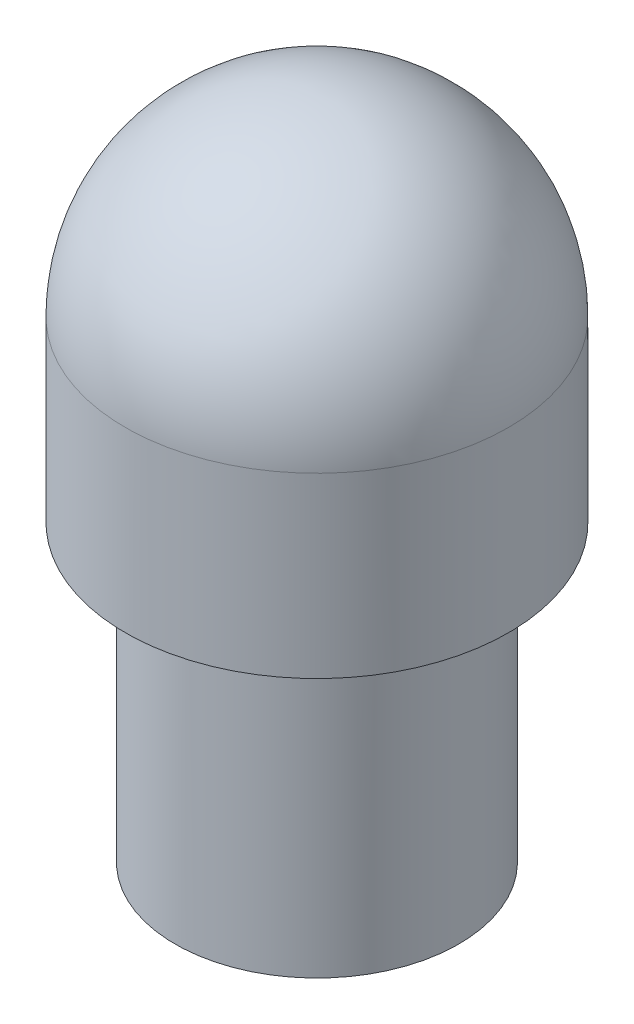
ISO-10303-21;
HEADER;
FILE_DESCRIPTION(('STEP AP214'),'2;1');
FILE_NAME('part.step','',(''),(''),'','','');
FILE_SCHEMA(('AUTOMOTIVE_DESIGN { 1 0 10303 214 1 1 1 1 }'));
ENDSEC;
DATA;
#1=APPLICATION_CONTEXT('core data for automotive mechanical design processes');
#2=APPLICATION_PROTOCOL_DEFINITION('international standard','automotive_design',2000,#1);
#3=PRODUCT_CONTEXT('',#1,'mechanical');
#4=PRODUCT('Part','Part','',(#3));
#5=PRODUCT_RELATED_PRODUCT_CATEGORY('part','',(#4));
#6=PRODUCT_DEFINITION_FORMATION('','',#4);
#7=PRODUCT_DEFINITION_CONTEXT('part definition',#1,'design');
#8=PRODUCT_DEFINITION('design','',#6,#7);
#9=PRODUCT_DEFINITION_SHAPE('','',#8);
#10=(LENGTH_UNIT() NAMED_UNIT(*) SI_UNIT(.MILLI.,.METRE.));
#11=(NAMED_UNIT(*) PLANE_ANGLE_UNIT() SI_UNIT($,.RADIAN.));
#12=(NAMED_UNIT(*) SI_UNIT($,.STERADIAN.) SOLID_ANGLE_UNIT());
#13=UNCERTAINTY_MEASURE_WITH_UNIT(LENGTH_MEASURE(1.E-05),#10,'distance_accuracy_value','');
#14=(GEOMETRIC_REPRESENTATION_CONTEXT(3) GLOBAL_UNCERTAINTY_ASSIGNED_CONTEXT((#13)) GLOBAL_UNIT_ASSIGNED_CONTEXT((#10,
#11,#12)) REPRESENTATION_CONTEXT('',''));
#15=CARTESIAN_POINT('',(0.,0.,0.));
#16=DIRECTION('',(0.,0.,1.));
#17=DIRECTION('',(1.,0.,0.));
#18=AXIS2_PLACEMENT_3D('',#15,#16,#17);
#19=CARTESIAN_POINT('',(-3.899,25.4,0.));
#20=DIRECTION('',(0.,1.,0.));
#21=DIRECTION('',(0.,0.,1.));
#22=AXIS2_PLACEMENT_3D('',#19,#20,#21);
#23=PLANE('',#22);
#24=CARTESIAN_POINT('',(0.,25.4,0.));
#25=DIRECTION('',(0.,-1.,0.));
#26=DIRECTION('',(0.,0.,-1.));
#27=AXIS2_PLACEMENT_3D('',#24,#25,#26);
#28=CIRCLE('',#27,3.5);
#29=CARTESIAN_POINT('',(0.,25.4,-3.5));
#30=VERTEX_POINT('',#29);
#31=EDGE_CURVE('E81',#30,#30,#28,.T.);
#32=ORIENTED_EDGE('',*,*,#31,.F.);
#33=EDGE_LOOP('',(#32));
#34=FACE_BOUND('',#33,.T.);
#35=CARTESIAN_POINT('',(0.,25.4,0.));
#36=DIRECTION('',(0.,-1.,0.));
#37=DIRECTION('',(0.,0.,-1.));
#38=AXIS2_PLACEMENT_3D('',#35,#36,#37);
#39=CIRCLE('',#38,3.899);
#40=CARTESIAN_POINT('',(0.,25.4,-3.899));
#41=VERTEX_POINT('',#40);
#42=EDGE_CURVE('E71',#41,#41,#39,.T.);
#43=ORIENTED_EDGE('',*,*,#42,.T.);
#44=EDGE_LOOP('',(#43));
#45=FACE_BOUND('',#44,.T.);
#46=ADVANCED_FACE('F51',(#34,#45),#23,.F.);
#47=CARTESIAN_POINT('',(0.,38.3921,0.));
#48=DIRECTION('',(0.,-1.,0.));
#49=DIRECTION('',(1.,0.,0.));
#50=AXIS2_PLACEMENT_3D('',#47,#48,#49);
#51=SPHERICAL_SURFACE('',#50,5.2705);
#52=CARTESIAN_POINT('',(0.,38.3921,0.));
#53=DIRECTION('',(0.,-1.,0.));
#54=DIRECTION('',(0.,0.,-1.));
#55=AXIS2_PLACEMENT_3D('',#52,#53,#54);
#56=CIRCLE('',#55,5.2705);
#57=CARTESIAN_POINT('',(0.,38.3921,-5.2705));
#58=VERTEX_POINT('',#57);
#59=EDGE_CURVE('E86',#58,#58,#56,.T.);
#60=ORIENTED_EDGE('',*,*,#59,.F.);
#61=EDGE_LOOP('',(#60));
#62=FACE_BOUND('',#61,.T.);
#63=ADVANCED_FACE('F102',(#62),#51,.T.);
#64=CARTESIAN_POINT('',(0.,25.4,0.));
#65=DIRECTION('',(0.,-1.,0.));
#66=DIRECTION('',(0.,0.,-1.));
#67=AXIS2_PLACEMENT_3D('',#64,#65,#66);
#68=CYLINDRICAL_SURFACE('',#67,5.2705);
#69=CARTESIAN_POINT('',(0.,33.5026,0.));
#70=DIRECTION('',(0.,-1.,0.));
#71=DIRECTION('',(0.,0.,-1.));
#72=AXIS2_PLACEMENT_3D('',#69,#70,#71);
#73=CIRCLE('',#72,5.2705);
#74=CARTESIAN_POINT('',(0.,33.5026,-5.2705));
#75=VERTEX_POINT('',#74);
#76=EDGE_CURVE('E75',#75,#75,#73,.T.);
#77=ORIENTED_EDGE('',*,*,#76,.F.);
#78=EDGE_LOOP('',(#77));
#79=FACE_BOUND('',#78,.T.);
#80=ORIENTED_EDGE('',*,*,#59,.T.);
#81=EDGE_LOOP('',(#80));
#82=FACE_BOUND('',#81,.T.);
#83=ADVANCED_FACE('F108',(#79,#82),#68,.T.);
#84=CARTESIAN_POINT('',(-5.2705,33.5026,0.));
#85=DIRECTION('',(0.,1.,0.));
#86=DIRECTION('',(0.,0.,1.));
#87=AXIS2_PLACEMENT_3D('',#84,#85,#86);
#88=PLANE('',#87);
#89=CARTESIAN_POINT('',(0.,33.5026,0.));
#90=DIRECTION('',(0.,1.,0.));
#91=DIRECTION('',(0.,0.,1.));
#92=AXIS2_PLACEMENT_3D('',#89,#90,#91);
#93=CIRCLE('',#92,4.661);
#94=CARTESIAN_POINT('',(0.,33.5026,4.661));
#95=VERTEX_POINT('',#94);
#96=EDGE_CURVE('E13',#95,#95,#93,.T.);
#97=ORIENTED_EDGE('',*,*,#96,.T.);
#98=EDGE_LOOP('',(#97));
#99=FACE_BOUND('',#98,.T.);
#100=ORIENTED_EDGE('',*,*,#76,.T.);
#101=EDGE_LOOP('',(#100));
#102=FACE_BOUND('',#101,.T.);
#103=ADVANCED_FACE('F116',(#99,#102),#88,.F.);
#104=CARTESIAN_POINT('',(0.,25.4,0.));
#105=DIRECTION('',(0.,-1.,0.));
#106=DIRECTION('',(0.,0.,-1.));
#107=AXIS2_PLACEMENT_3D('',#104,#105,#106);
#108=CYLINDRICAL_SURFACE('',#107,3.899);
#109=CARTESIAN_POINT('',(0.,32.7406,0.));
#110=DIRECTION('',(0.,1.,0.));
#111=DIRECTION('',(0.,0.,1.));
#112=AXIS2_PLACEMENT_3D('',#109,#110,#111);
#113=CIRCLE('',#112,3.899);
#114=CARTESIAN_POINT('',(0.,32.7406,3.899));
#115=VERTEX_POINT('',#114);
#116=EDGE_CURVE('E58',#115,#115,#113,.F.);
#117=ORIENTED_EDGE('',*,*,#116,.T.);
#118=EDGE_LOOP('',(#117));
#119=FACE_BOUND('',#118,.T.);
#120=ORIENTED_EDGE('',*,*,#42,.F.);
#121=EDGE_LOOP('',(#120));
#122=FACE_BOUND('',#121,.T.);
#123=ADVANCED_FACE('F91',(#119,#122),#108,.T.);
#124=CARTESIAN_POINT('',(0.,27.9,0.));
#125=DIRECTION('',(0.,-1.,0.));
#126=DIRECTION('',(0.,0.,-1.));
#127=AXIS2_PLACEMENT_3D('',#124,#125,#126);
#128=PLANE('',#127);
#129=CARTESIAN_POINT('',(0.,27.9,0.));
#130=DIRECTION('',(0.,-1.,0.));
#131=DIRECTION('',(0.,0.,-1.));
#132=AXIS2_PLACEMENT_3D('',#129,#130,#131);
#133=CIRCLE('',#132,3.5);
#134=CARTESIAN_POINT('',(0.,27.9,-3.5));
#135=VERTEX_POINT('',#134);
#136=EDGE_CURVE('E78',#135,#135,#133,.T.);
#137=ORIENTED_EDGE('',*,*,#136,.T.);
#138=EDGE_LOOP('',(#137));
#139=FACE_BOUND('',#138,.T.);
#140=CARTESIAN_POINT('',(0.,27.9,0.));
#141=DIRECTION('',(0.,-1.,0.));
#142=DIRECTION('',(0.,0.,-1.));
#143=AXIS2_PLACEMENT_3D('',#140,#141,#142);
#144=CIRCLE('',#143,2.99999999999999);
#145=CARTESIAN_POINT('',(0.,27.9,-2.99999999999999));
#146=VERTEX_POINT('',#145);
#147=EDGE_CURVE('E72',#146,#146,#144,.F.);
#148=ORIENTED_EDGE('',*,*,#147,.T.);
#149=EDGE_LOOP('',(#148));
#150=FACE_BOUND('',#149,.T.);
#151=ADVANCED_FACE('F115',(#139,#150),#128,.T.);
#152=CARTESIAN_POINT('',(0.,27.9,0.));
#153=DIRECTION('',(0.,-1.,0.));
#154=DIRECTION('',(0.,0.,-1.));
#155=AXIS2_PLACEMENT_3D('',#152,#153,#154);
#156=CYLINDRICAL_SURFACE('',#155,3.5);
#157=ORIENTED_EDGE('',*,*,#136,.F.);
#158=EDGE_LOOP('',(#157));
#159=FACE_BOUND('',#158,.T.);
#160=ORIENTED_EDGE('',*,*,#31,.T.);
#161=EDGE_LOOP('',(#160));
#162=FACE_BOUND('',#161,.T.);
#163=ADVANCED_FACE('F65',(#159,#162),#156,.F.);
#164=CARTESIAN_POINT('',(0.,41.402,0.));
#165=DIRECTION('',(0.,-1.,0.));
#166=DIRECTION('',(0.,0.,-1.));
#167=AXIS2_PLACEMENT_3D('',#164,#165,#166);
#168=CONICAL_SURFACE('',#167,3.,1.02974425867665);
#169=CARTESIAN_POINT('',(0.,43.2045818570827,0.));
#170=VERTEX_POINT('',#169);
#171=VERTEX_LOOP('',#170);
#172=FACE_BOUND('',#171,.T.);
#173=CARTESIAN_POINT('',(0.,41.402,0.));
#174=DIRECTION('',(0.,-1.,0.));
#175=DIRECTION('',(0.,0.,-1.));
#176=AXIS2_PLACEMENT_3D('',#173,#174,#175);
#177=CIRCLE('',#176,3.);
#178=CARTESIAN_POINT('',(0.,41.402,-3.));
#179=VERTEX_POINT('',#178);
#180=EDGE_CURVE('E69',#179,#179,#177,.T.);
#181=ORIENTED_EDGE('',*,*,#180,.T.);
#182=EDGE_LOOP('',(#181));
#183=FACE_BOUND('',#182,.T.);
#184=ADVANCED_FACE('F61',(#172,#183),#168,.F.);
#185=CARTESIAN_POINT('',(0.,25.4,0.));
#186=DIRECTION('',(0.,-1.,0.));
#187=DIRECTION('',(0.,0.,-1.));
#188=AXIS2_PLACEMENT_3D('',#185,#186,#187);
#189=CYLINDRICAL_SURFACE('',#188,2.99999999999999);
#190=ORIENTED_EDGE('',*,*,#180,.F.);
#191=EDGE_LOOP('',(#190));
#192=FACE_BOUND('',#191,.T.);
#193=ORIENTED_EDGE('',*,*,#147,.F.);
#194=EDGE_LOOP('',(#193));
#195=FACE_BOUND('',#194,.T.);
#196=ADVANCED_FACE('F64',(#192,#195),#189,.F.);
#197=CARTESIAN_POINT('',(0.,32.7406,0.));
#198=DIRECTION('',(0.,1.,0.));
#199=DIRECTION('',(0.,0.,1.));
#200=AXIS2_PLACEMENT_3D('',#197,#198,#199);
#201=TOROIDAL_SURFACE('',#200,4.661,0.762);
#202=ORIENTED_EDGE('',*,*,#96,.F.);
#203=EDGE_LOOP('',(#202));
#204=FACE_BOUND('',#203,.T.);
#205=ORIENTED_EDGE('',*,*,#116,.F.);
#206=EDGE_LOOP('',(#205));
#207=FACE_BOUND('',#206,.T.);
#208=ADVANCED_FACE('F53',(#204,#207),#201,.F.);
#209=CLOSED_SHELL('',(#46,#63,#83,#103,#123,#151,#163,#184,#196,#208));
#210=MANIFOLD_SOLID_BREP('B2',#209);
#211=ADVANCED_BREP_SHAPE_REPRESENTATION('',(#18,#210),#14);
#212=SHAPE_DEFINITION_REPRESENTATION(#9,#211);
ENDSEC;
END-ISO-10303-21;
